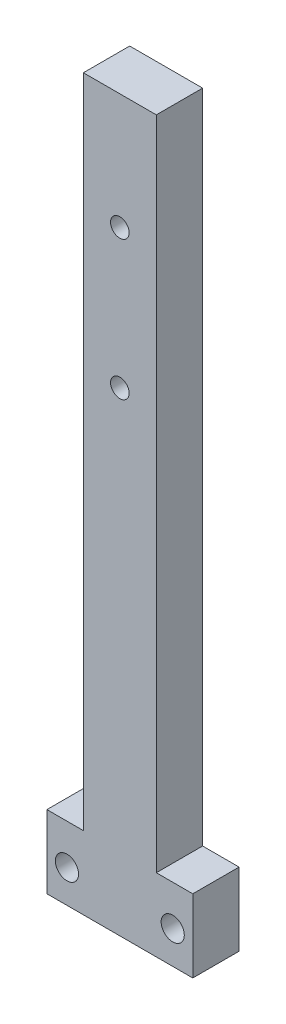
ISO-10303-21;
HEADER;
FILE_DESCRIPTION(('STEP AP214'),'2;1');
FILE_NAME('part.step','',(''),(''),'','','');
FILE_SCHEMA(('AUTOMOTIVE_DESIGN { 1 0 10303 214 1 1 1 1 }'));
ENDSEC;
DATA;
#1=APPLICATION_CONTEXT('core data for automotive mechanical design processes');
#2=APPLICATION_PROTOCOL_DEFINITION('international standard','automotive_design',2000,#1);
#3=PRODUCT_CONTEXT('',#1,'mechanical');
#4=PRODUCT('Part','Part','',(#3));
#5=PRODUCT_RELATED_PRODUCT_CATEGORY('part','',(#4));
#6=PRODUCT_DEFINITION_FORMATION('','',#4);
#7=PRODUCT_DEFINITION_CONTEXT('part definition',#1,'design');
#8=PRODUCT_DEFINITION('design','',#6,#7);
#9=PRODUCT_DEFINITION_SHAPE('','',#8);
#10=(LENGTH_UNIT() NAMED_UNIT(*) SI_UNIT(.MILLI.,.METRE.));
#11=(NAMED_UNIT(*) PLANE_ANGLE_UNIT() SI_UNIT($,.RADIAN.));
#12=(NAMED_UNIT(*) SI_UNIT($,.STERADIAN.) SOLID_ANGLE_UNIT());
#13=UNCERTAINTY_MEASURE_WITH_UNIT(LENGTH_MEASURE(1.E-05),#10,'distance_accuracy_value','');
#14=(GEOMETRIC_REPRESENTATION_CONTEXT(3) GLOBAL_UNCERTAINTY_ASSIGNED_CONTEXT((#13)) GLOBAL_UNIT_ASSIGNED_CONTEXT((#10,
#11,#12)) REPRESENTATION_CONTEXT('',''));
#15=CARTESIAN_POINT('',(0.,0.,0.));
#16=DIRECTION('',(0.,0.,1.));
#17=DIRECTION('',(1.,0.,0.));
#18=AXIS2_PLACEMENT_3D('',#15,#16,#17);
#19=CARTESIAN_POINT('',(-20.,20.,12.7));
#20=DIRECTION('',(1.,0.,0.));
#21=DIRECTION('',(0.,0.,-1.));
#22=AXIS2_PLACEMENT_3D('',#19,#20,#21);
#23=PLANE('',#22);
#24=DIRECTION('',(0.,-1.,0.));
#25=VECTOR('',#24,1.);
#26=CARTESIAN_POINT('',(-20.,20.,0.));
#27=LINE('',#26,#25);
#28=CARTESIAN_POINT('',(-20.,20.,0.));
#29=VERTEX_POINT('',#28);
#30=CARTESIAN_POINT('',(-20.,0.,0.));
#31=VERTEX_POINT('',#30);
#32=EDGE_CURVE('E132',#29,#31,#27,.T.);
#33=ORIENTED_EDGE('',*,*,#32,.T.);
#34=DIRECTION('',(0.,0.,-1.));
#35=VECTOR('',#34,1.);
#36=CARTESIAN_POINT('',(-20.,0.,12.7));
#37=LINE('',#36,#35);
#38=CARTESIAN_POINT('',(-20.,0.,12.7));
#39=VERTEX_POINT('',#38);
#40=EDGE_CURVE('E11',#39,#31,#37,.T.);
#41=ORIENTED_EDGE('',*,*,#40,.F.);
#42=DIRECTION('',(0.,-1.,0.));
#43=VECTOR('',#42,1.);
#44=CARTESIAN_POINT('',(-20.,20.,12.7));
#45=LINE('',#44,#43);
#46=CARTESIAN_POINT('',(-20.,20.,12.7));
#47=VERTEX_POINT('',#46);
#48=EDGE_CURVE('E147',#47,#39,#45,.T.);
#49=ORIENTED_EDGE('',*,*,#48,.F.);
#50=DIRECTION('',(0.,0.,-1.));
#51=VECTOR('',#50,1.);
#52=CARTESIAN_POINT('',(-20.,20.,12.7));
#53=LINE('',#52,#51);
#54=EDGE_CURVE('E128',#47,#29,#53,.T.);
#55=ORIENTED_EDGE('',*,*,#54,.T.);
#56=EDGE_LOOP('',(#33,#41,#49,#55));
#57=FACE_BOUND('',#56,.T.);
#58=ADVANCED_FACE('F36',(#57),#23,.F.);
#59=CARTESIAN_POINT('',(-20.,0.,12.7));
#60=DIRECTION('',(0.,1.,0.));
#61=DIRECTION('',(0.,0.,1.));
#62=AXIS2_PLACEMENT_3D('',#59,#60,#61);
#63=PLANE('',#62);
#64=DIRECTION('',(1.,0.,0.));
#65=VECTOR('',#64,1.);
#66=CARTESIAN_POINT('',(-20.,0.,0.));
#67=LINE('',#66,#65);
#68=CARTESIAN_POINT('',(20.,0.,0.));
#69=VERTEX_POINT('',#68);
#70=EDGE_CURVE('E135',#31,#69,#67,.T.);
#71=ORIENTED_EDGE('',*,*,#70,.T.);
#72=DIRECTION('',(0.,0.,-1.));
#73=VECTOR('',#72,1.);
#74=CARTESIAN_POINT('',(20.,0.,12.7));
#75=LINE('',#74,#73);
#76=CARTESIAN_POINT('',(20.,0.,12.7));
#77=VERTEX_POINT('',#76);
#78=EDGE_CURVE('E44',#77,#69,#75,.T.);
#79=ORIENTED_EDGE('',*,*,#78,.F.);
#80=DIRECTION('',(1.,0.,0.));
#81=VECTOR('',#80,1.);
#82=CARTESIAN_POINT('',(-20.,0.,12.7));
#83=LINE('',#82,#81);
#84=EDGE_CURVE('E95',#39,#77,#83,.T.);
#85=ORIENTED_EDGE('',*,*,#84,.F.);
#86=ORIENTED_EDGE('',*,*,#40,.T.);
#87=EDGE_LOOP('',(#71,#79,#85,#86));
#88=FACE_BOUND('',#87,.T.);
#89=ADVANCED_FACE('F238',(#88),#63,.F.);
#90=CARTESIAN_POINT('',(20.,0.,12.7));
#91=DIRECTION('',(-1.,0.,0.));
#92=DIRECTION('',(0.,0.,1.));
#93=AXIS2_PLACEMENT_3D('',#90,#91,#92);
#94=PLANE('',#93);
#95=DIRECTION('',(0.,1.,0.));
#96=VECTOR('',#95,1.);
#97=CARTESIAN_POINT('',(20.,0.,0.));
#98=LINE('',#97,#96);
#99=CARTESIAN_POINT('',(20.,20.,0.));
#100=VERTEX_POINT('',#99);
#101=EDGE_CURVE('E138',#69,#100,#98,.T.);
#102=ORIENTED_EDGE('',*,*,#101,.T.);
#103=DIRECTION('',(0.,0.,-1.));
#104=VECTOR('',#103,1.);
#105=CARTESIAN_POINT('',(20.,20.,12.7));
#106=LINE('',#105,#104);
#107=CARTESIAN_POINT('',(20.,20.,12.7));
#108=VERTEX_POINT('',#107);
#109=EDGE_CURVE('E154',#108,#100,#106,.T.);
#110=ORIENTED_EDGE('',*,*,#109,.F.);
#111=DIRECTION('',(0.,1.,0.));
#112=VECTOR('',#111,1.);
#113=CARTESIAN_POINT('',(20.,0.,12.7));
#114=LINE('',#113,#112);
#115=EDGE_CURVE('E162',#77,#108,#114,.T.);
#116=ORIENTED_EDGE('',*,*,#115,.F.);
#117=ORIENTED_EDGE('',*,*,#78,.T.);
#118=EDGE_LOOP('',(#102,#110,#116,#117));
#119=FACE_BOUND('',#118,.T.);
#120=ADVANCED_FACE('F160',(#119),#94,.F.);
#121=CARTESIAN_POINT('',(20.,20.,12.7));
#122=DIRECTION('',(0.,-1.,0.));
#123=DIRECTION('',(1.,0.,0.));
#124=AXIS2_PLACEMENT_3D('',#121,#122,#123);
#125=PLANE('',#124);
#126=DIRECTION('',(-1.,0.,0.));
#127=VECTOR('',#126,1.);
#128=CARTESIAN_POINT('',(20.,20.,0.));
#129=LINE('',#128,#127);
#130=CARTESIAN_POINT('',(9.99999999999998,20.,0.));
#131=VERTEX_POINT('',#130);
#132=EDGE_CURVE('E140',#100,#131,#129,.T.);
#133=ORIENTED_EDGE('',*,*,#132,.T.);
#134=DIRECTION('',(0.,0.,-1.));
#135=VECTOR('',#134,1.);
#136=CARTESIAN_POINT('',(9.99999999999998,20.,12.7));
#137=LINE('',#136,#135);
#138=CARTESIAN_POINT('',(9.99999999999998,20.,12.7));
#139=VERTEX_POINT('',#138);
#140=EDGE_CURVE('E151',#139,#131,#137,.T.);
#141=ORIENTED_EDGE('',*,*,#140,.F.);
#142=DIRECTION('',(-1.,0.,0.));
#143=VECTOR('',#142,1.);
#144=CARTESIAN_POINT('',(20.,20.,12.7));
#145=LINE('',#144,#143);
#146=EDGE_CURVE('E174',#108,#139,#145,.T.);
#147=ORIENTED_EDGE('',*,*,#146,.F.);
#148=ORIENTED_EDGE('',*,*,#109,.T.);
#149=EDGE_LOOP('',(#133,#141,#147,#148));
#150=FACE_BOUND('',#149,.T.);
#151=ADVANCED_FACE('F170',(#150),#125,.F.);
#152=CARTESIAN_POINT('',(9.99999999999998,20.,12.7));
#153=DIRECTION('',(-1.,0.,0.));
#154=DIRECTION('',(0.,-1.,0.));
#155=AXIS2_PLACEMENT_3D('',#152,#153,#154);
#156=PLANE('',#155);
#157=DIRECTION('',(0.,1.,0.));
#158=VECTOR('',#157,1.);
#159=CARTESIAN_POINT('',(9.99999999999998,20.,0.));
#160=LINE('',#159,#158);
#161=CARTESIAN_POINT('',(10.,200.,0.));
#162=VERTEX_POINT('',#161);
#163=EDGE_CURVE('E142',#131,#162,#160,.T.);
#164=ORIENTED_EDGE('',*,*,#163,.T.);
#165=DIRECTION('',(0.,0.,-1.));
#166=VECTOR('',#165,1.);
#167=CARTESIAN_POINT('',(10.,200.,12.7));
#168=LINE('',#167,#166);
#169=CARTESIAN_POINT('',(10.,200.,12.7));
#170=VERTEX_POINT('',#169);
#171=EDGE_CURVE('E123',#170,#162,#168,.T.);
#172=ORIENTED_EDGE('',*,*,#171,.F.);
#173=DIRECTION('',(0.,1.,0.));
#174=VECTOR('',#173,1.);
#175=CARTESIAN_POINT('',(9.99999999999998,20.,12.7));
#176=LINE('',#175,#174);
#177=EDGE_CURVE('E114',#139,#170,#176,.T.);
#178=ORIENTED_EDGE('',*,*,#177,.F.);
#179=ORIENTED_EDGE('',*,*,#140,.T.);
#180=EDGE_LOOP('',(#164,#172,#178,#179));
#181=FACE_BOUND('',#180,.T.);
#182=ADVANCED_FACE('F173',(#181),#156,.F.);
#183=CARTESIAN_POINT('',(10.,200.,12.7));
#184=DIRECTION('',(0.,-1.,0.));
#185=DIRECTION('',(0.,0.,-1.));
#186=AXIS2_PLACEMENT_3D('',#183,#184,#185);
#187=PLANE('',#186);
#188=DIRECTION('',(-1.,0.,0.));
#189=VECTOR('',#188,1.);
#190=CARTESIAN_POINT('',(10.,200.,0.));
#191=LINE('',#190,#189);
#192=CARTESIAN_POINT('',(-10.,200.,0.));
#193=VERTEX_POINT('',#192);
#194=EDGE_CURVE('E122',#162,#193,#191,.T.);
#195=ORIENTED_EDGE('',*,*,#194,.T.);
#196=DIRECTION('',(0.,0.,-1.));
#197=VECTOR('',#196,1.);
#198=CARTESIAN_POINT('',(-10.,200.,12.7));
#199=LINE('',#198,#197);
#200=CARTESIAN_POINT('',(-10.,200.,12.7));
#201=VERTEX_POINT('',#200);
#202=EDGE_CURVE('E119',#201,#193,#199,.T.);
#203=ORIENTED_EDGE('',*,*,#202,.F.);
#204=DIRECTION('',(-1.,0.,0.));
#205=VECTOR('',#204,1.);
#206=CARTESIAN_POINT('',(10.,200.,12.7));
#207=LINE('',#206,#205);
#208=EDGE_CURVE('E108',#170,#201,#207,.T.);
#209=ORIENTED_EDGE('',*,*,#208,.F.);
#210=ORIENTED_EDGE('',*,*,#171,.T.);
#211=EDGE_LOOP('',(#195,#203,#209,#210));
#212=FACE_BOUND('',#211,.T.);
#213=ADVANCED_FACE('F120',(#212),#187,.F.);
#214=CARTESIAN_POINT('',(-10.,200.,12.7));
#215=DIRECTION('',(1.,0.,0.));
#216=DIRECTION('',(0.,1.,0.));
#217=AXIS2_PLACEMENT_3D('',#214,#215,#216);
#218=PLANE('',#217);
#219=DIRECTION('',(0.,-1.,0.));
#220=VECTOR('',#219,1.);
#221=CARTESIAN_POINT('',(-10.,200.,0.));
#222=LINE('',#221,#220);
#223=CARTESIAN_POINT('',(-9.99999999999998,20.,0.));
#224=VERTEX_POINT('',#223);
#225=EDGE_CURVE('E81',#193,#224,#222,.T.);
#226=ORIENTED_EDGE('',*,*,#225,.T.);
#227=DIRECTION('',(0.,0.,-1.));
#228=VECTOR('',#227,1.);
#229=CARTESIAN_POINT('',(-9.99999999999998,20.,12.7));
#230=LINE('',#229,#228);
#231=CARTESIAN_POINT('',(-9.99999999999998,20.,12.7));
#232=VERTEX_POINT('',#231);
#233=EDGE_CURVE('E124',#232,#224,#230,.T.);
#234=ORIENTED_EDGE('',*,*,#233,.F.);
#235=DIRECTION('',(0.,-1.,0.));
#236=VECTOR('',#235,1.);
#237=CARTESIAN_POINT('',(-10.,200.,12.7));
#238=LINE('',#237,#236);
#239=EDGE_CURVE('E112',#201,#232,#238,.T.);
#240=ORIENTED_EDGE('',*,*,#239,.F.);
#241=ORIENTED_EDGE('',*,*,#202,.T.);
#242=EDGE_LOOP('',(#226,#234,#240,#241));
#243=FACE_BOUND('',#242,.T.);
#244=ADVANCED_FACE('F126',(#243),#218,.F.);
#245=CARTESIAN_POINT('',(-9.99999999999998,20.,12.7));
#246=DIRECTION('',(0.,-1.,0.));
#247=DIRECTION('',(1.,0.,0.));
#248=AXIS2_PLACEMENT_3D('',#245,#246,#247);
#249=PLANE('',#248);
#250=DIRECTION('',(-1.,0.,0.));
#251=VECTOR('',#250,1.);
#252=CARTESIAN_POINT('',(-9.99999999999998,20.,0.));
#253=LINE('',#252,#251);
#254=EDGE_CURVE('E87',#224,#29,#253,.T.);
#255=ORIENTED_EDGE('',*,*,#254,.T.);
#256=ORIENTED_EDGE('',*,*,#54,.F.);
#257=DIRECTION('',(-1.,0.,0.));
#258=VECTOR('',#257,1.);
#259=CARTESIAN_POINT('',(-9.99999999999998,20.,12.7));
#260=LINE('',#259,#258);
#261=EDGE_CURVE('E52',#232,#47,#260,.T.);
#262=ORIENTED_EDGE('',*,*,#261,.F.);
#263=ORIENTED_EDGE('',*,*,#233,.T.);
#264=EDGE_LOOP('',(#255,#256,#262,#263));
#265=FACE_BOUND('',#264,.T.);
#266=ADVANCED_FACE('F245',(#265),#249,.F.);
#267=CARTESIAN_POINT('',(0.,0.,12.7));
#268=DIRECTION('',(0.,0.,1.));
#269=DIRECTION('',(1.,0.,0.));
#270=AXIS2_PLACEMENT_3D('',#267,#268,#269);
#271=PLANE('',#270);
#272=CARTESIAN_POINT('',(-14.5,9.00000000000009,12.7));
#273=DIRECTION('',(0.,0.,1.));
#274=DIRECTION('',(1.,0.,0.));
#275=AXIS2_PLACEMENT_3D('',#272,#273,#274);
#276=CIRCLE('',#275,3.175);
#277=CARTESIAN_POINT('',(-11.325,9.00000000000009,12.7));
#278=VERTEX_POINT('',#277);
#279=EDGE_CURVE('E203',#278,#278,#276,.T.);
#280=ORIENTED_EDGE('',*,*,#279,.F.);
#281=EDGE_LOOP('',(#280));
#282=FACE_BOUND('',#281,.T.);
#283=CARTESIAN_POINT('',(14.5,9.00000000000008,12.7));
#284=DIRECTION('',(0.,0.,1.));
#285=DIRECTION('',(1.,0.,0.));
#286=AXIS2_PLACEMENT_3D('',#283,#284,#285);
#287=CIRCLE('',#286,3.175);
#288=CARTESIAN_POINT('',(17.675,9.00000000000008,12.7));
#289=VERTEX_POINT('',#288);
#290=EDGE_CURVE('E197',#289,#289,#287,.T.);
#291=ORIENTED_EDGE('',*,*,#290,.F.);
#292=EDGE_LOOP('',(#291));
#293=FACE_BOUND('',#292,.T.);
#294=CARTESIAN_POINT('',(0.,168.25,12.7));
#295=DIRECTION('',(0.,0.,-1.));
#296=DIRECTION('',(-1.,0.,0.));
#297=AXIS2_PLACEMENT_3D('',#294,#295,#296);
#298=CIRCLE('',#297,2.5527);
#299=CARTESIAN_POINT('',(-2.5527,168.25,12.7));
#300=VERTEX_POINT('',#299);
#301=EDGE_CURVE('E188',#300,#300,#298,.T.);
#302=ORIENTED_EDGE('',*,*,#301,.T.);
#303=EDGE_LOOP('',(#302));
#304=FACE_BOUND('',#303,.T.);
#305=CARTESIAN_POINT('',(0.,130.15,12.7));
#306=DIRECTION('',(0.,0.,-1.));
#307=DIRECTION('',(-1.,0.,0.));
#308=AXIS2_PLACEMENT_3D('',#305,#306,#307);
#309=CIRCLE('',#308,2.5527);
#310=CARTESIAN_POINT('',(-2.55270000000001,130.15,12.7));
#311=VERTEX_POINT('',#310);
#312=EDGE_CURVE('E136',#311,#311,#309,.T.);
#313=ORIENTED_EDGE('',*,*,#312,.T.);
#314=EDGE_LOOP('',(#313));
#315=FACE_BOUND('',#314,.T.);
#316=ORIENTED_EDGE('',*,*,#48,.T.);
#317=ORIENTED_EDGE('',*,*,#84,.T.);
#318=ORIENTED_EDGE('',*,*,#115,.T.);
#319=ORIENTED_EDGE('',*,*,#146,.T.);
#320=ORIENTED_EDGE('',*,*,#177,.T.);
#321=ORIENTED_EDGE('',*,*,#208,.T.);
#322=ORIENTED_EDGE('',*,*,#239,.T.);
#323=ORIENTED_EDGE('',*,*,#261,.T.);
#324=EDGE_LOOP('',(#316,#317,#318,#319,#320,#321,#322,#323));
#325=FACE_BOUND('',#324,.T.);
#326=ADVANCED_FACE('F110',(#282,#293,#304,#315,#325),#271,.T.);
#327=CARTESIAN_POINT('',(0.,0.,0.));
#328=DIRECTION('',(0.,0.,1.));
#329=DIRECTION('',(1.,0.,0.));
#330=AXIS2_PLACEMENT_3D('',#327,#328,#329);
#331=PLANE('',#330);
#332=CARTESIAN_POINT('',(-14.5,9.00000000000009,0.));
#333=DIRECTION('',(0.,0.,-1.));
#334=DIRECTION('',(-1.,0.,0.));
#335=AXIS2_PLACEMENT_3D('',#332,#333,#334);
#336=CIRCLE('',#335,3.175);
#337=CARTESIAN_POINT('',(-17.675,9.00000000000009,0.));
#338=VERTEX_POINT('',#337);
#339=EDGE_CURVE('E206',#338,#338,#336,.T.);
#340=ORIENTED_EDGE('',*,*,#339,.F.);
#341=EDGE_LOOP('',(#340));
#342=FACE_BOUND('',#341,.T.);
#343=CARTESIAN_POINT('',(14.5,9.00000000000008,0.));
#344=DIRECTION('',(0.,0.,-1.));
#345=DIRECTION('',(-1.,0.,0.));
#346=AXIS2_PLACEMENT_3D('',#343,#344,#345);
#347=CIRCLE('',#346,3.175);
#348=CARTESIAN_POINT('',(11.325,9.00000000000008,0.));
#349=VERTEX_POINT('',#348);
#350=EDGE_CURVE('E200',#349,#349,#347,.T.);
#351=ORIENTED_EDGE('',*,*,#350,.F.);
#352=EDGE_LOOP('',(#351));
#353=FACE_BOUND('',#352,.T.);
#354=CARTESIAN_POINT('',(0.,168.25,0.));
#355=DIRECTION('',(0.,0.,-1.));
#356=DIRECTION('',(-1.,0.,0.));
#357=AXIS2_PLACEMENT_3D('',#354,#355,#356);
#358=CIRCLE('',#357,3.81);
#359=CARTESIAN_POINT('',(-3.81,168.25,0.));
#360=VERTEX_POINT('',#359);
#361=EDGE_CURVE('E194',#360,#360,#358,.T.);
#362=ORIENTED_EDGE('',*,*,#361,.F.);
#363=EDGE_LOOP('',(#362));
#364=FACE_BOUND('',#363,.T.);
#365=CARTESIAN_POINT('',(0.,130.15,0.));
#366=DIRECTION('',(0.,0.,-1.));
#367=DIRECTION('',(-1.,0.,0.));
#368=AXIS2_PLACEMENT_3D('',#365,#366,#367);
#369=CIRCLE('',#368,3.81);
#370=CARTESIAN_POINT('',(-3.81000000000001,130.15,0.));
#371=VERTEX_POINT('',#370);
#372=EDGE_CURVE('E185',#371,#371,#369,.T.);
#373=ORIENTED_EDGE('',*,*,#372,.F.);
#374=EDGE_LOOP('',(#373));
#375=FACE_BOUND('',#374,.T.);
#376=ORIENTED_EDGE('',*,*,#32,.F.);
#377=ORIENTED_EDGE('',*,*,#254,.F.);
#378=ORIENTED_EDGE('',*,*,#225,.F.);
#379=ORIENTED_EDGE('',*,*,#194,.F.);
#380=ORIENTED_EDGE('',*,*,#163,.F.);
#381=ORIENTED_EDGE('',*,*,#132,.F.);
#382=ORIENTED_EDGE('',*,*,#101,.F.);
#383=ORIENTED_EDGE('',*,*,#70,.F.);
#384=EDGE_LOOP('',(#376,#377,#378,#379,#380,#381,#382,#383));
#385=FACE_BOUND('',#384,.T.);
#386=ADVANCED_FACE('F166',(#342,#353,#364,#375,#385),#331,.F.);
#387=CARTESIAN_POINT('',(0.,130.15,0.));
#388=DIRECTION('',(0.,0.,-1.));
#389=DIRECTION('',(-1.,0.,0.));
#390=AXIS2_PLACEMENT_3D('',#387,#388,#389);
#391=CYLINDRICAL_SURFACE('',#390,2.5527);
#392=ORIENTED_EDGE('',*,*,#312,.F.);
#393=EDGE_LOOP('',(#392));
#394=FACE_BOUND('',#393,.T.);
#395=CARTESIAN_POINT('',(0.,130.15,1.0549999662792));
#396=DIRECTION('',(0.,0.,-1.));
#397=DIRECTION('',(-1.,0.,0.));
#398=AXIS2_PLACEMENT_3D('',#395,#396,#397);
#399=CIRCLE('',#398,2.5527);
#400=CARTESIAN_POINT('',(-2.55270000000001,130.15,1.0549999662792));
#401=VERTEX_POINT('',#400);
#402=EDGE_CURVE('E182',#401,#401,#399,.T.);
#403=ORIENTED_EDGE('',*,*,#402,.T.);
#404=EDGE_LOOP('',(#403));
#405=FACE_BOUND('',#404,.T.);
#406=ADVANCED_FACE('F214',(#394,#405),#391,.F.);
#407=CARTESIAN_POINT('',(0.,130.15,0.));
#408=DIRECTION('',(0.,0.,-1.));
#409=DIRECTION('',(-1.,0.,0.));
#410=AXIS2_PLACEMENT_3D('',#407,#408,#409);
#411=CONICAL_SURFACE('',#410,3.81,0.872664625997165);
#412=ORIENTED_EDGE('',*,*,#402,.F.);
#413=EDGE_LOOP('',(#412));
#414=FACE_BOUND('',#413,.T.);
#415=ORIENTED_EDGE('',*,*,#372,.T.);
#416=EDGE_LOOP('',(#415));
#417=FACE_BOUND('',#416,.T.);
#418=ADVANCED_FACE('F222',(#414,#417),#411,.F.);
#419=CARTESIAN_POINT('',(0.,168.25,0.));
#420=DIRECTION('',(0.,0.,-1.));
#421=DIRECTION('',(-1.,0.,0.));
#422=AXIS2_PLACEMENT_3D('',#419,#420,#421);
#423=CYLINDRICAL_SURFACE('',#422,2.5527);
#424=ORIENTED_EDGE('',*,*,#301,.F.);
#425=EDGE_LOOP('',(#424));
#426=FACE_BOUND('',#425,.T.);
#427=CARTESIAN_POINT('',(0.,168.25,1.0549999662792));
#428=DIRECTION('',(0.,0.,-1.));
#429=DIRECTION('',(-1.,0.,0.));
#430=AXIS2_PLACEMENT_3D('',#427,#428,#429);
#431=CIRCLE('',#430,2.5527);
#432=CARTESIAN_POINT('',(-2.5527,168.25,1.0549999662792));
#433=VERTEX_POINT('',#432);
#434=EDGE_CURVE('E191',#433,#433,#431,.T.);
#435=ORIENTED_EDGE('',*,*,#434,.T.);
#436=EDGE_LOOP('',(#435));
#437=FACE_BOUND('',#436,.T.);
#438=ADVANCED_FACE('F224',(#426,#437),#423,.F.);
#439=CARTESIAN_POINT('',(0.,168.25,0.));
#440=DIRECTION('',(0.,0.,-1.));
#441=DIRECTION('',(-1.,0.,0.));
#442=AXIS2_PLACEMENT_3D('',#439,#440,#441);
#443=CONICAL_SURFACE('',#442,3.81,0.872664625997165);
#444=ORIENTED_EDGE('',*,*,#434,.F.);
#445=EDGE_LOOP('',(#444));
#446=FACE_BOUND('',#445,.T.);
#447=ORIENTED_EDGE('',*,*,#361,.T.);
#448=EDGE_LOOP('',(#447));
#449=FACE_BOUND('',#448,.T.);
#450=ADVANCED_FACE('F231',(#446,#449),#443,.F.);
#451=CARTESIAN_POINT('',(14.5,9.00000000000008,0.));
#452=DIRECTION('',(0.,0.,-1.));
#453=DIRECTION('',(-1.,0.,0.));
#454=AXIS2_PLACEMENT_3D('',#451,#452,#453);
#455=CYLINDRICAL_SURFACE('',#454,3.175);
#456=ORIENTED_EDGE('',*,*,#290,.T.);
#457=EDGE_LOOP('',(#456));
#458=FACE_BOUND('',#457,.T.);
#459=ORIENTED_EDGE('',*,*,#350,.T.);
#460=EDGE_LOOP('',(#459));
#461=FACE_BOUND('',#460,.T.);
#462=ADVANCED_FACE('F317',(#458,#461),#455,.F.);
#463=CARTESIAN_POINT('',(-14.5,9.00000000000009,0.));
#464=DIRECTION('',(0.,0.,-1.));
#465=DIRECTION('',(-1.,0.,0.));
#466=AXIS2_PLACEMENT_3D('',#463,#464,#465);
#467=CYLINDRICAL_SURFACE('',#466,3.175);
#468=ORIENTED_EDGE('',*,*,#279,.T.);
#469=EDGE_LOOP('',(#468));
#470=FACE_BOUND('',#469,.T.);
#471=ORIENTED_EDGE('',*,*,#339,.T.);
#472=EDGE_LOOP('',(#471));
#473=FACE_BOUND('',#472,.T.);
#474=ADVANCED_FACE('F210',(#470,#473),#467,.F.);
#475=CLOSED_SHELL('',(#58,#89,#120,#151,#182,#213,#244,#266,#326,#386,#406,#418,#438,#450,#462,#474));
#476=MANIFOLD_SOLID_BREP('B2',#475);
#477=ADVANCED_BREP_SHAPE_REPRESENTATION('',(#18,#476),#14);
#478=SHAPE_DEFINITION_REPRESENTATION(#9,#477);
ENDSEC;
END-ISO-10303-21;
